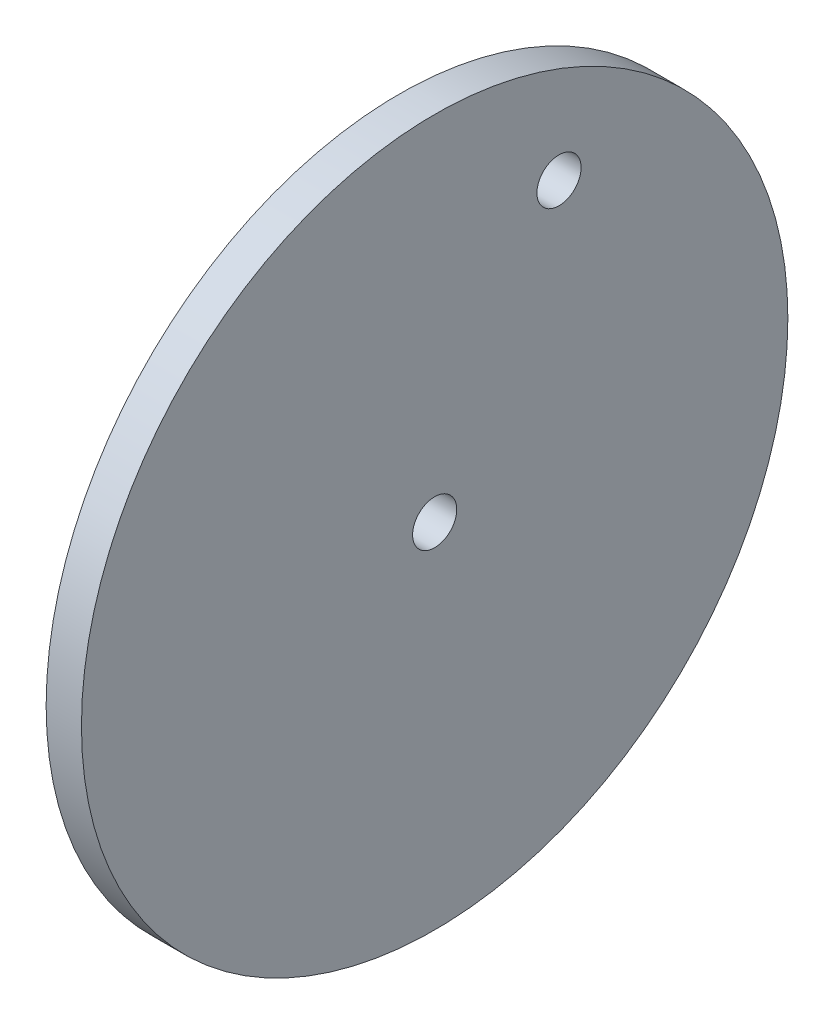
ISO-10303-21;
HEADER;
FILE_DESCRIPTION(('STEP AP214'),'2;1');
FILE_NAME('part.step','',(''),(''),'','','');
FILE_SCHEMA(('AUTOMOTIVE_DESIGN { 1 0 10303 214 1 1 1 1 }'));
ENDSEC;
DATA;
#1=APPLICATION_CONTEXT('core data for automotive mechanical design processes');
#2=APPLICATION_PROTOCOL_DEFINITION('international standard','automotive_design',2000,#1);
#3=PRODUCT_CONTEXT('',#1,'mechanical');
#4=PRODUCT('Part','Part','',(#3));
#5=PRODUCT_RELATED_PRODUCT_CATEGORY('part','',(#4));
#6=PRODUCT_DEFINITION_FORMATION('','',#4);
#7=PRODUCT_DEFINITION_CONTEXT('part definition',#1,'design');
#8=PRODUCT_DEFINITION('design','',#6,#7);
#9=PRODUCT_DEFINITION_SHAPE('','',#8);
#10=(LENGTH_UNIT() NAMED_UNIT(*) SI_UNIT(.MILLI.,.METRE.));
#11=(NAMED_UNIT(*) PLANE_ANGLE_UNIT() SI_UNIT($,.RADIAN.));
#12=(NAMED_UNIT(*) SI_UNIT($,.STERADIAN.) SOLID_ANGLE_UNIT());
#13=UNCERTAINTY_MEASURE_WITH_UNIT(LENGTH_MEASURE(1.E-05),#10,'distance_accuracy_value','');
#14=(GEOMETRIC_REPRESENTATION_CONTEXT(3) GLOBAL_UNCERTAINTY_ASSIGNED_CONTEXT((#13)) GLOBAL_UNIT_ASSIGNED_CONTEXT((#10,
#11,#12)) REPRESENTATION_CONTEXT('',''));
#15=CARTESIAN_POINT('',(0.,0.,0.));
#16=DIRECTION('',(0.,0.,1.));
#17=DIRECTION('',(1.,0.,0.));
#18=AXIS2_PLACEMENT_3D('',#15,#16,#17);
#19=CARTESIAN_POINT('',(23.,-0.886481836998391,0.471210641275219));
#20=DIRECTION('',(-1.,0.,0.));
#21=DIRECTION('',(0.,0.,1.));
#22=AXIS2_PLACEMENT_3D('',#19,#20,#21);
#23=CYLINDRICAL_SURFACE('',#22,60.);
#24=CARTESIAN_POINT('',(23.,-0.886481836998391,0.471210641275219));
#25=DIRECTION('',(1.,0.,0.));
#26=DIRECTION('',(0.,0.,-1.));
#27=AXIS2_PLACEMENT_3D('',#24,#25,#26);
#28=CIRCLE('',#27,60.);
#29=CARTESIAN_POINT('',(23.,-0.886481836998391,-59.5287893587248));
#30=VERTEX_POINT('',#29);
#31=EDGE_CURVE('E10',#30,#30,#28,.T.);
#32=ORIENTED_EDGE('',*,*,#31,.F.);
#33=EDGE_LOOP('',(#32));
#34=FACE_BOUND('',#33,.T.);
#35=CARTESIAN_POINT('',(17.,-0.886481836998391,0.471210641275219));
#36=DIRECTION('',(1.,0.,0.));
#37=DIRECTION('',(0.,0.,-1.));
#38=AXIS2_PLACEMENT_3D('',#35,#36,#37);
#39=CIRCLE('',#38,60.);
#40=CARTESIAN_POINT('',(17.,-0.886481836998391,-59.5287893587248));
#41=VERTEX_POINT('',#40);
#42=EDGE_CURVE('E37',#41,#41,#39,.T.);
#43=ORIENTED_EDGE('',*,*,#42,.T.);
#44=EDGE_LOOP('',(#43));
#45=FACE_BOUND('',#44,.T.);
#46=ADVANCED_FACE('F34',(#34,#45),#23,.T.);
#47=CARTESIAN_POINT('',(23.,-0.886481836998391,0.471210641275219));
#48=DIRECTION('',(1.,0.,0.));
#49=DIRECTION('',(0.,0.,-1.));
#50=AXIS2_PLACEMENT_3D('',#47,#48,#49);
#51=PLANE('',#50);
#52=CARTESIAN_POINT('',(23.,38.8487628566942,-20.6501133970608));
#53=DIRECTION('',(1.,0.,0.));
#54=DIRECTION('',(0.,0.,-1.));
#55=AXIS2_PLACEMENT_3D('',#52,#53,#54);
#56=CIRCLE('',#55,3.75);
#57=CARTESIAN_POINT('',(23.,38.8487628566942,-24.4001133970608));
#58=VERTEX_POINT('',#57);
#59=EDGE_CURVE('E52',#58,#58,#56,.T.);
#60=ORIENTED_EDGE('',*,*,#59,.F.);
#61=EDGE_LOOP('',(#60));
#62=FACE_BOUND('',#61,.T.);
#63=CARTESIAN_POINT('',(23.,-0.886481836998391,0.471210641275219));
#64=DIRECTION('',(1.,0.,0.));
#65=DIRECTION('',(0.,0.,-1.));
#66=AXIS2_PLACEMENT_3D('',#63,#64,#65);
#67=CIRCLE('',#66,3.75);
#68=CARTESIAN_POINT('',(23.,-0.886481836998391,-3.27878935872478));
#69=VERTEX_POINT('',#68);
#70=EDGE_CURVE('E48',#69,#69,#67,.T.);
#71=ORIENTED_EDGE('',*,*,#70,.F.);
#72=EDGE_LOOP('',(#71));
#73=FACE_BOUND('',#72,.T.);
#74=ORIENTED_EDGE('',*,*,#31,.T.);
#75=EDGE_LOOP('',(#74));
#76=FACE_BOUND('',#75,.T.);
#77=ADVANCED_FACE('F68',(#62,#73,#76),#51,.T.);
#78=CARTESIAN_POINT('',(17.,-0.886481836998391,0.471210641275219));
#79=DIRECTION('',(1.,0.,0.));
#80=DIRECTION('',(0.,0.,-1.));
#81=AXIS2_PLACEMENT_3D('',#78,#79,#80);
#82=PLANE('',#81);
#83=CARTESIAN_POINT('',(17.,38.8487628566942,-20.6501133970608));
#84=DIRECTION('',(1.,0.,0.));
#85=DIRECTION('',(0.,0.,-1.));
#86=AXIS2_PLACEMENT_3D('',#83,#84,#85);
#87=CIRCLE('',#86,3.75);
#88=CARTESIAN_POINT('',(17.,38.8487628566942,-24.4001133970608));
#89=VERTEX_POINT('',#88);
#90=EDGE_CURVE('E51',#89,#89,#87,.T.);
#91=ORIENTED_EDGE('',*,*,#90,.T.);
#92=EDGE_LOOP('',(#91));
#93=FACE_BOUND('',#92,.T.);
#94=CARTESIAN_POINT('',(17.,-0.886481836998391,0.471210641275219));
#95=DIRECTION('',(1.,0.,0.));
#96=DIRECTION('',(0.,0.,-1.));
#97=AXIS2_PLACEMENT_3D('',#94,#95,#96);
#98=CIRCLE('',#97,3.75);
#99=CARTESIAN_POINT('',(17.,-0.886481836998391,-3.27878935872478));
#100=VERTEX_POINT('',#99);
#101=EDGE_CURVE('E44',#100,#100,#98,.F.);
#102=ORIENTED_EDGE('',*,*,#101,.F.);
#103=EDGE_LOOP('',(#102));
#104=FACE_BOUND('',#103,.T.);
#105=ORIENTED_EDGE('',*,*,#42,.F.);
#106=EDGE_LOOP('',(#105));
#107=FACE_BOUND('',#106,.T.);
#108=ADVANCED_FACE('F58',(#93,#104,#107),#82,.F.);
#109=CARTESIAN_POINT('',(6.39339828220179,-0.886481836998391,0.471210641275219));
#110=DIRECTION('',(1.,0.,0.));
#111=DIRECTION('',(0.,0.,-1.));
#112=AXIS2_PLACEMENT_3D('',#109,#110,#111);
#113=CYLINDRICAL_SURFACE('',#112,3.75);
#114=ORIENTED_EDGE('',*,*,#101,.T.);
#115=EDGE_LOOP('',(#114));
#116=FACE_BOUND('',#115,.T.);
#117=ORIENTED_EDGE('',*,*,#70,.T.);
#118=EDGE_LOOP('',(#117));
#119=FACE_BOUND('',#118,.T.);
#120=ADVANCED_FACE('F64',(#116,#119),#113,.F.);
#121=CARTESIAN_POINT('',(17.,38.8487628566942,-20.6501133970608));
#122=DIRECTION('',(1.,0.,0.));
#123=DIRECTION('',(0.,0.,-1.));
#124=AXIS2_PLACEMENT_3D('',#121,#122,#123);
#125=CYLINDRICAL_SURFACE('',#124,3.75);
#126=ORIENTED_EDGE('',*,*,#90,.F.);
#127=EDGE_LOOP('',(#126));
#128=FACE_BOUND('',#127,.T.);
#129=ORIENTED_EDGE('',*,*,#59,.T.);
#130=EDGE_LOOP('',(#129));
#131=FACE_BOUND('',#130,.T.);
#132=ADVANCED_FACE('F61',(#128,#131),#125,.F.);
#133=CLOSED_SHELL('',(#46,#77,#108,#120,#132));
#134=MANIFOLD_SOLID_BREP('B2',#133);
#135=ADVANCED_BREP_SHAPE_REPRESENTATION('',(#18,#134),#14);
#136=SHAPE_DEFINITION_REPRESENTATION(#9,#135);
ENDSEC;
END-ISO-10303-21;
